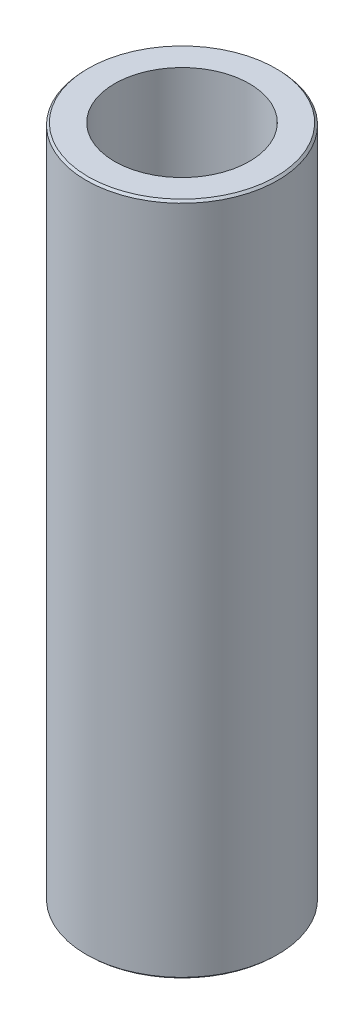
ISO-10303-21;
HEADER;
FILE_DESCRIPTION(('STEP AP214'),'2;1');
FILE_NAME('part.step','',(''),(''),'','','');
FILE_SCHEMA(('AUTOMOTIVE_DESIGN { 1 0 10303 214 1 1 1 1 }'));
ENDSEC;
DATA;
#1=APPLICATION_CONTEXT('core data for automotive mechanical design processes');
#2=APPLICATION_PROTOCOL_DEFINITION('international standard','automotive_design',2000,#1);
#3=PRODUCT_CONTEXT('',#1,'mechanical');
#4=PRODUCT('Part','Part','',(#3));
#5=PRODUCT_RELATED_PRODUCT_CATEGORY('part','',(#4));
#6=PRODUCT_DEFINITION_FORMATION('','',#4);
#7=PRODUCT_DEFINITION_CONTEXT('part definition',#1,'design');
#8=PRODUCT_DEFINITION('design','',#6,#7);
#9=PRODUCT_DEFINITION_SHAPE('','',#8);
#10=(LENGTH_UNIT() NAMED_UNIT(*) SI_UNIT(.MILLI.,.METRE.));
#11=(NAMED_UNIT(*) PLANE_ANGLE_UNIT() SI_UNIT($,.RADIAN.));
#12=(NAMED_UNIT(*) SI_UNIT($,.STERADIAN.) SOLID_ANGLE_UNIT());
#13=UNCERTAINTY_MEASURE_WITH_UNIT(LENGTH_MEASURE(1.E-05),#10,'distance_accuracy_value','');
#14=(GEOMETRIC_REPRESENTATION_CONTEXT(3) GLOBAL_UNCERTAINTY_ASSIGNED_CONTEXT((#13)) GLOBAL_UNIT_ASSIGNED_CONTEXT((#10,
#11,#12)) REPRESENTATION_CONTEXT('',''));
#15=CARTESIAN_POINT('',(0.,0.,0.));
#16=DIRECTION('',(0.,0.,1.));
#17=DIRECTION('',(1.,0.,0.));
#18=AXIS2_PLACEMENT_3D('',#15,#16,#17);
#19=CARTESIAN_POINT('',(0.,351.867280978688,0.));
#20=DIRECTION('',(0.,-1.,0.));
#21=DIRECTION('',(0.,0.,-1.));
#22=AXIS2_PLACEMENT_3D('',#19,#20,#21);
#23=CYLINDRICAL_SURFACE('',#22,50.);
#24=CARTESIAN_POINT('',(0.,350.743094989711,0.));
#25=DIRECTION('',(0.,1.,0.));
#26=DIRECTION('',(0.,0.,1.));
#27=AXIS2_PLACEMENT_3D('',#24,#25,#26);
#28=CIRCLE('',#27,50.);
#29=CARTESIAN_POINT('',(0.,350.743094989711,50.));
#30=VERTEX_POINT('',#29);
#31=EDGE_CURVE('E50',#30,#30,#28,.F.);
#32=ORIENTED_EDGE('',*,*,#31,.T.);
#33=EDGE_LOOP('',(#32));
#34=FACE_BOUND('',#33,.T.);
#35=CARTESIAN_POINT('',(0.,1.06089007972615,0.));
#36=DIRECTION('',(0.,1.,0.));
#37=DIRECTION('',(0.,0.,1.));
#38=AXIS2_PLACEMENT_3D('',#35,#36,#37);
#39=CIRCLE('',#38,50.);
#40=CARTESIAN_POINT('',(0.,1.06089007972615,50.));
#41=VERTEX_POINT('',#40);
#42=EDGE_CURVE('E51',#41,#41,#39,.T.);
#43=ORIENTED_EDGE('',*,*,#42,.T.);
#44=EDGE_LOOP('',(#43));
#45=FACE_BOUND('',#44,.T.);
#46=ADVANCED_FACE('F39',(#34,#45),#23,.T.);
#47=CARTESIAN_POINT('',(0.,351.867280978688,0.));
#48=DIRECTION('',(0.,1.,0.));
#49=DIRECTION('',(0.,0.,1.));
#50=AXIS2_PLACEMENT_3D('',#47,#48,#49);
#51=PLANE('',#50);
#52=CARTESIAN_POINT('',(0.,351.867280978688,0.));
#53=DIRECTION('',(0.,1.,0.));
#54=DIRECTION('',(0.,0.,1.));
#55=AXIS2_PLACEMENT_3D('',#52,#53,#54);
#56=CIRCLE('',#55,48.9391099202738);
#57=CARTESIAN_POINT('',(0.,351.867280978688,48.9391099202738));
#58=VERTEX_POINT('',#57);
#59=EDGE_CURVE('E54',#58,#58,#56,.T.);
#60=ORIENTED_EDGE('',*,*,#59,.T.);
#61=EDGE_LOOP('',(#60));
#62=FACE_BOUND('',#61,.T.);
#63=CARTESIAN_POINT('',(0.,351.867280978688,0.));
#64=DIRECTION('',(0.,1.,0.));
#65=DIRECTION('',(0.,0.,1.));
#66=AXIS2_PLACEMENT_3D('',#63,#64,#65);
#67=CIRCLE('',#66,35.1684987500771);
#68=CARTESIAN_POINT('',(0.,351.867280978688,35.1684987500771));
#69=VERTEX_POINT('',#68);
#70=EDGE_CURVE('E58',#69,#69,#67,.T.);
#71=ORIENTED_EDGE('',*,*,#70,.F.);
#72=EDGE_LOOP('',(#71));
#73=FACE_BOUND('',#72,.T.);
#74=ADVANCED_FACE('F69',(#62,#73),#51,.T.);
#75=CARTESIAN_POINT('',(0.,0.,0.));
#76=DIRECTION('',(0.,1.,0.));
#77=DIRECTION('',(0.,0.,1.));
#78=AXIS2_PLACEMENT_3D('',#75,#76,#77);
#79=PLANE('',#78);
#80=CARTESIAN_POINT('',(0.,0.,0.));
#81=DIRECTION('',(0.,1.,0.));
#82=DIRECTION('',(0.,0.,1.));
#83=AXIS2_PLACEMENT_3D('',#80,#81,#82);
#84=CIRCLE('',#83,48.8758140110229);
#85=CARTESIAN_POINT('',(0.,0.,48.8758140110229));
#86=VERTEX_POINT('',#85);
#87=EDGE_CURVE('E10',#86,#86,#84,.F.);
#88=ORIENTED_EDGE('',*,*,#87,.T.);
#89=EDGE_LOOP('',(#88));
#90=FACE_BOUND('',#89,.T.);
#91=CARTESIAN_POINT('',(0.,0.,0.));
#92=DIRECTION('',(0.,1.,0.));
#93=DIRECTION('',(0.,0.,1.));
#94=AXIS2_PLACEMENT_3D('',#91,#92,#93);
#95=CIRCLE('',#94,35.1684987500771);
#96=CARTESIAN_POINT('',(0.,0.,35.1684987500771));
#97=VERTEX_POINT('',#96);
#98=EDGE_CURVE('E63',#97,#97,#95,.T.);
#99=ORIENTED_EDGE('',*,*,#98,.T.);
#100=EDGE_LOOP('',(#99));
#101=FACE_BOUND('',#100,.T.);
#102=ADVANCED_FACE('F75',(#90,#101),#79,.F.);
#103=CARTESIAN_POINT('',(0.,351.867280978688,0.));
#104=DIRECTION('',(0.,-1.,0.));
#105=DIRECTION('',(0.,0.,-1.));
#106=AXIS2_PLACEMENT_3D('',#103,#104,#105);
#107=CYLINDRICAL_SURFACE('',#106,35.1684987500771);
#108=ORIENTED_EDGE('',*,*,#70,.T.);
#109=EDGE_LOOP('',(#108));
#110=FACE_BOUND('',#109,.T.);
#111=ORIENTED_EDGE('',*,*,#98,.F.);
#112=EDGE_LOOP('',(#111));
#113=FACE_BOUND('',#112,.T.);
#114=ADVANCED_FACE('F70',(#110,#113),#107,.F.);
#115=CARTESIAN_POINT('',(0.,351.867280978688,0.));
#116=DIRECTION('',(0.,-1.,0.));
#117=DIRECTION('',(0.,0.,-1.));
#118=AXIS2_PLACEMENT_3D('',#115,#116,#117);
#119=CONICAL_SURFACE('',#118,48.9391099202738,0.756438890528938);
#120=ORIENTED_EDGE('',*,*,#31,.F.);
#121=EDGE_LOOP('',(#120));
#122=FACE_BOUND('',#121,.T.);
#123=ORIENTED_EDGE('',*,*,#59,.F.);
#124=EDGE_LOOP('',(#123));
#125=FACE_BOUND('',#124,.T.);
#126=ADVANCED_FACE('F81',(#122,#125),#119,.T.);
#127=CARTESIAN_POINT('',(0.,1.06089007972615,0.));
#128=DIRECTION('',(0.,1.,0.));
#129=DIRECTION('',(0.,0.,1.));
#130=AXIS2_PLACEMENT_3D('',#127,#128,#129);
#131=CONICAL_SURFACE('',#130,50.,0.814357436265956);
#132=ORIENTED_EDGE('',*,*,#87,.F.);
#133=EDGE_LOOP('',(#132));
#134=FACE_BOUND('',#133,.T.);
#135=ORIENTED_EDGE('',*,*,#42,.F.);
#136=EDGE_LOOP('',(#135));
#137=FACE_BOUND('',#136,.T.);
#138=ADVANCED_FACE('F45',(#134,#137),#131,.T.);
#139=CLOSED_SHELL('',(#46,#74,#102,#114,#126,#138));
#140=MANIFOLD_SOLID_BREP('B2',#139);
#141=ADVANCED_BREP_SHAPE_REPRESENTATION('',(#18,#140),#14);
#142=SHAPE_DEFINITION_REPRESENTATION(#9,#141);
ENDSEC;
END-ISO-10303-21;
